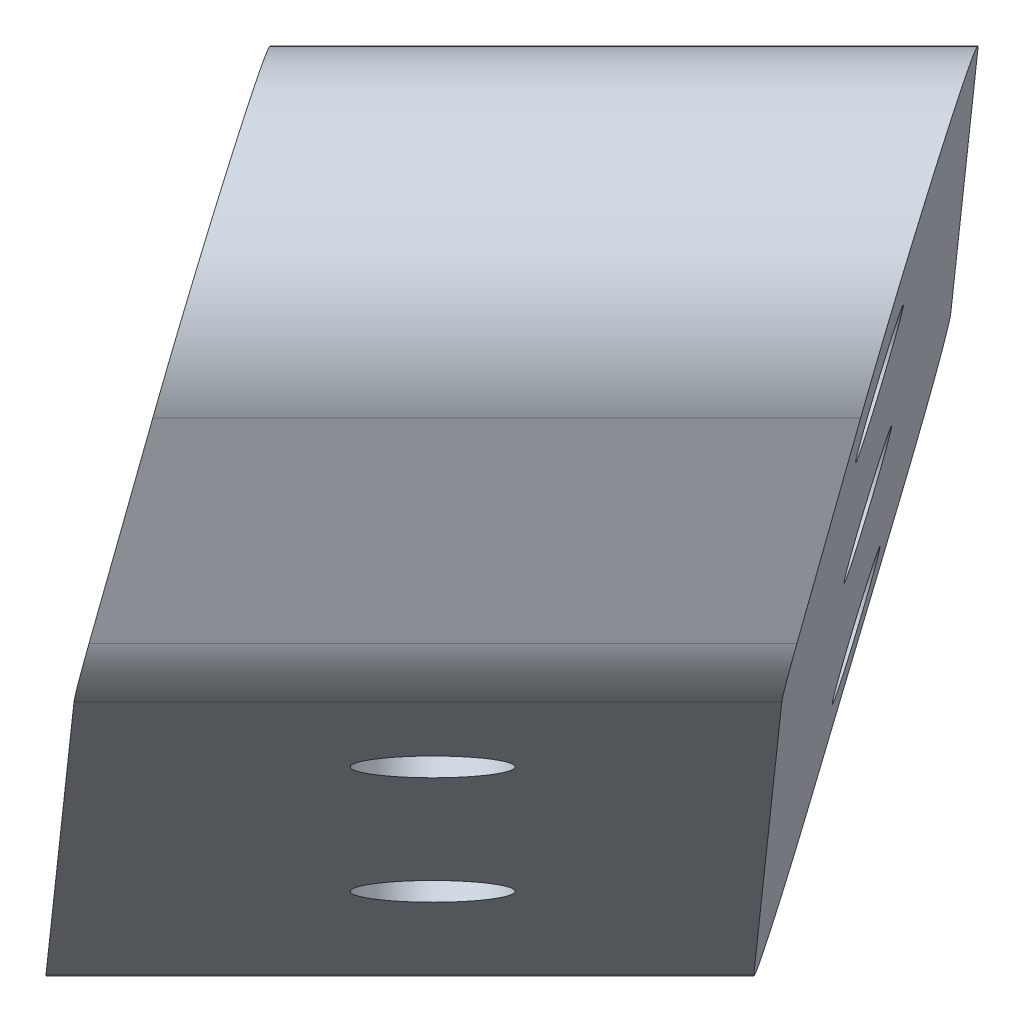
ISO-10303-21;
HEADER;
FILE_DESCRIPTION(('STEP AP214'),'2;1');
FILE_NAME('part.step','',(''),(''),'','','');
FILE_SCHEMA(('AUTOMOTIVE_DESIGN { 1 0 10303 214 1 1 1 1 }'));
ENDSEC;
DATA;
#1=APPLICATION_CONTEXT('core data for automotive mechanical design processes');
#2=APPLICATION_PROTOCOL_DEFINITION('international standard','automotive_design',2000,#1);
#3=PRODUCT_CONTEXT('',#1,'mechanical');
#4=PRODUCT('Part','Part','',(#3));
#5=PRODUCT_RELATED_PRODUCT_CATEGORY('part','',(#4));
#6=PRODUCT_DEFINITION_FORMATION('','',#4);
#7=PRODUCT_DEFINITION_CONTEXT('part definition',#1,'design');
#8=PRODUCT_DEFINITION('design','',#6,#7);
#9=PRODUCT_DEFINITION_SHAPE('','',#8);
#10=(LENGTH_UNIT() NAMED_UNIT(*) SI_UNIT(.MILLI.,.METRE.));
#11=(NAMED_UNIT(*) PLANE_ANGLE_UNIT() SI_UNIT($,.RADIAN.));
#12=(NAMED_UNIT(*) SI_UNIT($,.STERADIAN.) SOLID_ANGLE_UNIT());
#13=UNCERTAINTY_MEASURE_WITH_UNIT(LENGTH_MEASURE(1.E-05),#10,'distance_accuracy_value','');
#14=(GEOMETRIC_REPRESENTATION_CONTEXT(3) GLOBAL_UNCERTAINTY_ASSIGNED_CONTEXT((#13)) GLOBAL_UNIT_ASSIGNED_CONTEXT((#10,
#11,#12)) REPRESENTATION_CONTEXT('',''));
#15=CARTESIAN_POINT('',(0.,0.,0.));
#16=DIRECTION('',(0.,0.,1.));
#17=DIRECTION('',(1.,0.,0.));
#18=AXIS2_PLACEMENT_3D('',#15,#16,#17);
#19=CARTESIAN_POINT('',(211.29514255772,-94.0152812120288,94.4577052873248));
#20=DIRECTION('',(-0.635670633382854,-0.438001931170719,-0.635670633382856));
#21=DIRECTION('',(-0.707106781186548,0.,0.707106781186547));
#22=AXIS2_PLACEMENT_3D('',#19,#20,#21);
#23=PLANE('',#22);
#24=DIRECTION('',(-0.0983208560786328,0.86268066578759,-0.496099867099605));
#25=VECTOR('',#24,1.);
#26=CARTESIAN_POINT('',(202.848930690601,-112.979375377934,115.970919830593));
#27=LINE('',#26,#25);
#28=CARTESIAN_POINT('',(202.32292624561,-108.36414029038,113.316846771614));
#29=VERTEX_POINT('',#28);
#30=CARTESIAN_POINT('',(201.656406577888,-102.516005381434,109.953772732554));
#31=VERTEX_POINT('',#30);
#32=EDGE_CURVE('E115',#29,#31,#27,.T.);
#33=ORIENTED_EDGE('',*,*,#32,.T.);
#34=DIRECTION('',(0.707106781186548,0.,-0.707106781186547));
#35=VECTOR('',#34,1.);
#36=CARTESIAN_POINT('',(214.223808290423,-102.516005381431,97.3863710200276));
#37=LINE('',#36,#35);
#38=CARTESIAN_POINT('',(212.263981330594,-102.516005381431,99.3461979798563));
#39=VERTEX_POINT('',#38);
#40=EDGE_CURVE('E165',#31,#39,#37,.T.);
#41=ORIENTED_EDGE('',*,*,#40,.T.);
#42=DIRECTION('',(0.0983208560786335,-0.86268066578759,0.496099867099605));
#43=VECTOR('',#42,1.);
#44=CARTESIAN_POINT('',(211.29514255772,-94.0152812120288,94.4577052873248));
#45=LINE('',#44,#43);
#46=CARTESIAN_POINT('',(212.930500998316,-108.364140290378,102.709272018916));
#47=VERTEX_POINT('',#46);
#48=EDGE_CURVE('E196',#39,#47,#45,.T.);
#49=ORIENTED_EDGE('',*,*,#48,.T.);
#50=DIRECTION('',(-0.707106781186548,0.,0.707106781186547));
#51=VECTOR('',#50,1.);
#52=CARTESIAN_POINT('',(216.238605143813,-108.364140290378,99.4011678734184));
#53=LINE('',#52,#51);
#54=EDGE_CURVE('E159',#47,#29,#53,.T.);
#55=ORIENTED_EDGE('',*,*,#54,.T.);
#56=EDGE_LOOP('',(#33,#41,#49,#55));
#57=FACE_BOUND('',#56,.T.);
#58=ADVANCED_FACE('F41',(#57),#23,.T.);
#59=CARTESIAN_POINT('',(239.309137763312,-78.5635642195269,129.822442501016));
#60=DIRECTION('',(0.707106781186547,0.,0.707106781186548));
#61=DIRECTION('',(0.707106781186548,0.,-0.707106781186547));
#62=AXIS2_PLACEMENT_3D('',#59,#60,#61);
#63=PLANE('',#62);
#64=DIRECTION('',(0.158999682000955,0.97439119569462,-0.158999682000952));
#65=VECTOR('',#64,1.);
#66=CARTESIAN_POINT('',(239.309137763312,-78.5635642195269,129.822442501016));
#67=LINE('',#66,#65);
#68=CARTESIAN_POINT('',(239.522788555568,-77.2542568781109,129.608791708761));
#69=VERTEX_POINT('',#68);
#70=CARTESIAN_POINT('',(240.476466797243,-71.4098698295326,128.655113467085));
#71=VERTEX_POINT('',#70);
#72=EDGE_CURVE('E139',#69,#71,#67,.T.);
#73=ORIENTED_EDGE('',*,*,#72,.T.);
#74=DIRECTION('',(-0.707106781186548,0.,0.707106781186547));
#75=VECTOR('',#74,1.);
#76=CARTESIAN_POINT('',(239.309137763312,-71.4098698295326,129.822442501016));
#77=LINE('',#76,#75);
#78=CARTESIAN_POINT('',(229.868892044541,-71.4098698295326,139.262688219788));
#79=VERTEX_POINT('',#78);
#80=EDGE_CURVE('E11',#71,#79,#77,.T.);
#81=ORIENTED_EDGE('',*,*,#80,.T.);
#82=DIRECTION('',(-0.158999682000957,-0.97439119569462,0.158999682000954));
#83=VECTOR('',#82,1.);
#84=CARTESIAN_POINT('',(229.237901059904,-75.2767458651046,139.893679204425));
#85=LINE('',#84,#83);
#86=CARTESIAN_POINT('',(228.915213802865,-77.254256878111,140.216366461464));
#87=VERTEX_POINT('',#86);
#88=EDGE_CURVE('E217',#79,#87,#85,.T.);
#89=ORIENTED_EDGE('',*,*,#88,.T.);
#90=DIRECTION('',(-0.707106781186548,0.,0.707106781186547));
#91=VECTOR('',#90,1.);
#92=CARTESIAN_POINT('',(239.309137763312,-77.2542568781109,129.822442501016));
#93=LINE('',#92,#91);
#94=EDGE_CURVE('E151',#87,#69,#93,.F.);
#95=ORIENTED_EDGE('',*,*,#94,.T.);
#96=EDGE_LOOP('',(#73,#81,#89,#95));
#97=FACE_BOUND('',#96,.T.);
#98=ADVANCED_FACE('F249',(#97),#63,.T.);
#99=CARTESIAN_POINT('',(113.5360697668,-30.9927506207114,-76.39552603978));
#100=DIRECTION('',(-0.809172566386445,0.220885605875265,0.544471585048009));
#101=DIRECTION('',(0.558260781142676,0.,0.829665535163399));
#102=AXIS2_PLACEMENT_3D('',#99,#100,#101);
#103=PLANE('',#102);
#104=CARTESIAN_POINT('',(215.344864779369,-101.859589814984,103.65858760929));
#105=DIRECTION('',(0.809172566386445,-0.220885605875266,-0.544471585048008));
#106=DIRECTION('',(-0.558260781142675,0.,-0.8296655351634));
#107=AXIS2_PLACEMENT_3D('',#104,#105,#106);
#108=CIRCLE('',#107,1.75000000000021);
#109=CARTESIAN_POINT('',(214.367908412369,-101.859589814984,102.206672922754));
#110=VERTEX_POINT('',#109);
#111=EDGE_CURVE('E228',#110,#110,#108,.T.);
#112=ORIENTED_EDGE('',*,*,#111,.F.);
#113=EDGE_LOOP('',(#112));
#114=FACE_BOUND('',#113,.T.);
#115=CARTESIAN_POINT('',(225.92476635843,-88.3157293857225,113.887445182356));
#116=DIRECTION('',(0.809172566386445,-0.220885605875266,-0.544471585048008));
#117=DIRECTION('',(-0.558260781142675,0.,-0.8296655351634));
#118=AXIS2_PLACEMENT_3D('',#115,#116,#117);
#119=CIRCLE('',#118,1.75000000000026);
#120=CARTESIAN_POINT('',(224.94780999143,-88.3157293857225,112.43553049582));
#121=VERTEX_POINT('',#120);
#122=EDGE_CURVE('E220',#121,#121,#119,.T.);
#123=ORIENTED_EDGE('',*,*,#122,.F.);
#124=EDGE_LOOP('',(#123));
#125=FACE_BOUND('',#124,.T.);
#126=CARTESIAN_POINT('',(236.504667937491,-74.7718689564612,124.116302755422));
#127=DIRECTION('',(0.809172566386445,-0.220885605875266,-0.544471585048008));
#128=DIRECTION('',(-0.558260781142675,0.,-0.8296655351634));
#129=AXIS2_PLACEMENT_3D('',#126,#127,#128);
#130=CIRCLE('',#129,1.7500000000002);
#131=CARTESIAN_POINT('',(235.527711570492,-74.7718689564612,122.664388068886));
#132=VERTEX_POINT('',#131);
#133=EDGE_CURVE('E224',#132,#132,#130,.T.);
#134=ORIENTED_EDGE('',*,*,#133,.F.);
#135=EDGE_LOOP('',(#134));
#136=FACE_BOUND('',#135,.T.);
#137=ORIENTED_EDGE('',*,*,#48,.F.);
#138=CARTESIAN_POINT('',(215.178179703032,-100.325995725577,102.788705941247));
#139=DIRECTION('',(-0.809172566386445,0.220885605875265,0.544471585048009));
#140=DIRECTION('',(-0.232829945707229,0.73025303662238,-0.642277758361414));
#141=AXIS2_PLACEMENT_3D('',#138,#139,#140);
#142=ELLIPSE('',#141,5.22372722873458,5.);
#143=CARTESIAN_POINT('',(213.842365611367,-96.6599351696128,99.3161939208435));
#144=VERTEX_POINT('',#143);
#145=EDGE_CURVE('E172',#39,#144,#142,.F.);
#146=ORIENTED_EDGE('',*,*,#145,.T.);
#147=DIRECTION('',(-0.527989065999957,-0.679937623467728,-0.508834329008521));
#148=VECTOR('',#147,1.);
#149=CARTESIAN_POINT('',(162.247700073995,-163.102891147598,49.5933138278502));
#150=LINE('',#149,#148);
#151=CARTESIAN_POINT('',(236.296481661491,-67.7438092735679,120.955704678904));
#152=VERTEX_POINT('',#151);
#153=EDGE_CURVE('E194',#152,#144,#150,.T.);
#154=ORIENTED_EDGE('',*,*,#153,.F.);
#155=CARTESIAN_POINT('',(237.632295753156,-71.4098698295326,124.428216699307));
#156=DIRECTION('',(-0.809172566386445,0.220885605875265,0.544471585048009));
#157=DIRECTION('',(0.232829945707228,-0.73025303662238,0.642277758361413));
#158=AXIS2_PLACEMENT_3D('',#155,#156,#157);
#159=ELLIPSE('',#158,5.22372722873458,5.);
#160=EDGE_CURVE('E169',#152,#71,#159,.F.);
#161=ORIENTED_EDGE('',*,*,#160,.T.);
#162=ORIENTED_EDGE('',*,*,#72,.F.);
#163=CARTESIAN_POINT('',(237.816285929115,-77.2542568781109,127.072653648094));
#164=DIRECTION('',(-0.809172566386445,0.220885605875265,0.544471585048009));
#165=DIRECTION('',(0.232829945707229,-0.730253036622379,0.642277758361414));
#166=AXIS2_PLACEMENT_3D('',#163,#164,#165);
#167=ELLIPSE('',#166,3.13423633724075,3.);
#168=CARTESIAN_POINT('',(238.617774384114,-79.4538932116897,129.156160860337));
#169=VERTEX_POINT('',#168);
#170=EDGE_CURVE('E156',#69,#169,#167,.F.);
#171=ORIENTED_EDGE('',*,*,#170,.T.);
#172=DIRECTION('',(0.527989065999957,0.679937623467728,0.508834329008521));
#173=VECTOR('',#172,1.);
#174=CARTESIAN_POINT('',(213.344884736597,-112.,104.800137840152));
#175=LINE('',#174,#173);
#176=CARTESIAN_POINT('',(215.480508476778,-109.249770830444,106.858284007992));
#177=VERTEX_POINT('',#176);
#178=EDGE_CURVE('E145',#177,#169,#175,.T.);
#179=ORIENTED_EDGE('',*,*,#178,.F.);
#180=CARTESIAN_POINT('',(214.679020021779,-107.050134496865,104.77477679575));
#181=DIRECTION('',(-0.809172566386445,0.220885605875265,0.544471585048009));
#182=DIRECTION('',(0.232829945707229,-0.730253036622379,0.642277758361414));
#183=AXIS2_PLACEMENT_3D('',#180,#181,#182);
#184=ELLIPSE('',#183,3.13423633724075,3.);
#185=EDGE_CURVE('E137',#177,#47,#184,.F.);
#186=ORIENTED_EDGE('',*,*,#185,.T.);
#187=EDGE_LOOP('',(#137,#146,#154,#161,#162,#171,#179,#186));
#188=FACE_BOUND('',#187,.T.);
#189=ADVANCED_FACE('F193',(#114,#125,#136,#188),#103,.F.);
#190=CARTESIAN_POINT('',(172.047895278047,-1.26907291474908,73.0508000859975));
#191=DIRECTION('',(0.480832611206852,-0.733212111192935,0.480832611206852));
#192=DIRECTION('',(0.,-0.548387096774193,-0.836224606246176));
#193=AXIS2_PLACEMENT_3D('',#190,#191,#192);
#194=CYLINDRICAL_SURFACE('',#193,1.74999999999996);
#195=CARTESIAN_POINT('',(227.974648489544,-86.5506695424108,128.977553297495));
#196=DIRECTION('',(0.480832611206852,-0.733212111192935,0.480832611206852));
#197=DIRECTION('',(0.,-0.548387096774194,-0.836224606246176));
#198=AXIS2_PLACEMENT_3D('',#195,#196,#197);
#199=CIRCLE('',#198,1.74999999999996);
#200=CARTESIAN_POINT('',(227.974648489544,-87.5103469617656,127.514160236564));
#201=VERTEX_POINT('',#200);
#202=EDGE_CURVE('E236',#201,#201,#199,.T.);
#203=ORIENTED_EDGE('',*,*,#202,.T.);
#204=EDGE_LOOP('',(#203));
#205=FACE_BOUND('',#204,.T.);
#206=CARTESIAN_POINT('',(221.413603187686,-76.5458617043292,122.416507995637));
#207=DIRECTION('',(-0.480832611206852,0.733212111192935,-0.480832611206851));
#208=DIRECTION('',(-0.836224606246176,-0.548387096774193,0.));
#209=AXIS2_PLACEMENT_3D('',#206,#207,#208);
#210=CIRCLE('',#209,1.74999999999996);
#211=CARTESIAN_POINT('',(219.950210126755,-77.505539123684,122.416507995637));
#212=VERTEX_POINT('',#211);
#213=EDGE_CURVE('E188',#212,#212,#210,.F.);
#214=ORIENTED_EDGE('',*,*,#213,.F.);
#215=EDGE_LOOP('',(#214));
#216=FACE_BOUND('',#215,.T.);
#217=ADVANCED_FACE('F263',(#205,#216),#194,.F.);
#218=CARTESIAN_POINT('',(161.678710160594,-14.8690729147491,62.6816149685448));
#219=DIRECTION('',(0.480832611206852,-0.733212111192935,0.480832611206852));
#220=DIRECTION('',(0.,-0.548387096774193,-0.836224606246176));
#221=AXIS2_PLACEMENT_3D('',#218,#219,#220);
#222=CYLINDRICAL_SURFACE('',#221,1.74999999999998);
#223=CARTESIAN_POINT('',(217.605463372091,-100.150669542411,118.608368180042));
#224=DIRECTION('',(0.480832611206852,-0.733212111192935,0.480832611206852));
#225=DIRECTION('',(0.,-0.548387096774194,-0.836224606246176));
#226=AXIS2_PLACEMENT_3D('',#223,#224,#225);
#227=CIRCLE('',#226,1.74999999999998);
#228=CARTESIAN_POINT('',(217.605463372091,-101.110346961766,117.144975119111));
#229=VERTEX_POINT('',#228);
#230=EDGE_CURVE('E232',#229,#229,#227,.T.);
#231=ORIENTED_EDGE('',*,*,#230,.T.);
#232=EDGE_LOOP('',(#231));
#233=FACE_BOUND('',#232,.T.);
#234=CARTESIAN_POINT('',(211.044418070234,-90.1458617043292,112.047322878184));
#235=DIRECTION('',(-0.480832611206852,0.733212111192935,-0.480832611206851));
#236=DIRECTION('',(-0.836224606246176,-0.548387096774193,0.));
#237=AXIS2_PLACEMENT_3D('',#234,#235,#236);
#238=CIRCLE('',#237,1.74999999999998);
#239=CARTESIAN_POINT('',(209.581025009303,-91.105539123684,112.047322878184));
#240=VERTEX_POINT('',#239);
#241=EDGE_CURVE('E200',#240,#240,#238,.F.);
#242=ORIENTED_EDGE('',*,*,#241,.F.);
#243=EDGE_LOOP('',(#242));
#244=FACE_BOUND('',#243,.T.);
#245=ADVANCED_FACE('F285',(#233,#244),#222,.F.);
#246=CARTESIAN_POINT('',(202.848930690601,-112.979375377934,115.970919830593));
#247=DIRECTION('',(-0.809172566386443,0.220885605875266,0.544471585048011));
#248=DIRECTION('',(0.558260781142678,0.,0.829665535163398));
#249=AXIS2_PLACEMENT_3D('',#246,#247,#248);
#250=PLANE('',#249);
#251=CARTESIAN_POINT('',(224.88585492355,-71.6001987111428,131.934305738801));
#252=DIRECTION('',(-0.809172566386443,0.220885605875266,0.544471585048011));
#253=DIRECTION('',(0.558260781142678,0.,0.829665535163398));
#254=AXIS2_PLACEMENT_3D('',#251,#252,#253);
#255=CIRCLE('',#254,1.7500000000002);
#256=CARTESIAN_POINT('',(225.86281129055,-71.6001987111428,133.386220425337));
#257=VERTEX_POINT('',#256);
#258=EDGE_CURVE('E132',#257,#257,#255,.F.);
#259=ORIENTED_EDGE('',*,*,#258,.T.);
#260=EDGE_LOOP('',(#259));
#261=FACE_BOUND('',#260,.T.);
#262=CARTESIAN_POINT('',(214.305953344489,-85.144059140404,121.705448165735));
#263=DIRECTION('',(-0.809172566386443,0.220885605875266,0.544471585048011));
#264=DIRECTION('',(0.558260781142678,0.,0.829665535163398));
#265=AXIS2_PLACEMENT_3D('',#262,#263,#264);
#266=CIRCLE('',#265,1.75000000000026);
#267=CARTESIAN_POINT('',(215.282909711489,-85.144059140404,123.157362852271));
#268=VERTEX_POINT('',#267);
#269=EDGE_CURVE('E209',#268,#268,#266,.F.);
#270=ORIENTED_EDGE('',*,*,#269,.T.);
#271=EDGE_LOOP('',(#270));
#272=FACE_BOUND('',#271,.T.);
#273=CARTESIAN_POINT('',(203.726051765427,-98.6879195696652,111.476590592669));
#274=DIRECTION('',(-0.809172566386443,0.220885605875266,0.544471585048011));
#275=DIRECTION('',(0.558260781142678,0.,0.829665535163398));
#276=AXIS2_PLACEMENT_3D('',#273,#274,#275);
#277=CIRCLE('',#276,1.75000000000021);
#278=CARTESIAN_POINT('',(204.703008132427,-98.6879195696652,112.928505279205));
#279=VERTEX_POINT('',#278);
#280=EDGE_CURVE('E213',#279,#279,#277,.F.);
#281=ORIENTED_EDGE('',*,*,#280,.T.);
#282=EDGE_LOOP('',(#281));
#283=FACE_BOUND('',#282,.T.);
#284=DIRECTION('',(-0.527989065999958,-0.679937623467728,-0.50883432900852));
#285=VECTOR('',#284,1.);
#286=CARTESIAN_POINT('',(198.893172017548,-102.251016854686,105.739657955938));
#287=LINE('',#286,#285);
#288=CARTESIAN_POINT('',(225.688906908788,-67.7438092735679,131.563279431606));
#289=VERTEX_POINT('',#288);
#290=CARTESIAN_POINT('',(203.234790858664,-96.6599351696129,109.923768673546));
#291=VERTEX_POINT('',#290);
#292=EDGE_CURVE('E162',#289,#291,#287,.T.);
#293=ORIENTED_EDGE('',*,*,#292,.T.);
#294=CARTESIAN_POINT('',(204.570604950329,-100.325995725578,113.39628069395));
#295=DIRECTION('',(-0.809172566386443,0.220885605875266,0.544471585048011));
#296=DIRECTION('',(-0.232829945707225,0.730253036622384,-0.64227775836141));
#297=AXIS2_PLACEMENT_3D('',#294,#295,#296);
#298=ELLIPSE('',#297,5.22372722873458,5.);
#299=EDGE_CURVE('E50',#291,#31,#298,.T.);
#300=ORIENTED_EDGE('',*,*,#299,.T.);
#301=ORIENTED_EDGE('',*,*,#32,.F.);
#302=CARTESIAN_POINT('',(204.071445269076,-107.050134496865,115.382351548453));
#303=DIRECTION('',(-0.809172566386443,0.220885605875266,0.544471585048011));
#304=DIRECTION('',(0.232829945707225,-0.730253036622384,0.64227775836141));
#305=AXIS2_PLACEMENT_3D('',#302,#303,#304);
#306=ELLIPSE('',#305,3.13423633724075,3.);
#307=CARTESIAN_POINT('',(204.872933724075,-109.249770830444,117.465858760695));
#308=VERTEX_POINT('',#307);
#309=EDGE_CURVE('E109',#29,#308,#306,.T.);
#310=ORIENTED_EDGE('',*,*,#309,.T.);
#311=DIRECTION('',(0.527989065999958,0.679937623467728,0.508834329008519));
#312=VECTOR('',#311,1.);
#313=CARTESIAN_POINT('',(202.568142035103,-112.21785233914,115.244681830939));
#314=LINE('',#313,#312);
#315=CARTESIAN_POINT('',(228.010199631411,-79.4538932116898,139.763735613039));
#316=VERTEX_POINT('',#315);
#317=EDGE_CURVE('E113',#308,#316,#314,.T.);
#318=ORIENTED_EDGE('',*,*,#317,.T.);
#319=CARTESIAN_POINT('',(227.208711176412,-77.254256878111,137.680228400797));
#320=DIRECTION('',(-0.809172566386443,0.220885605875266,0.544471585048011));
#321=DIRECTION('',(0.232829945707225,-0.730253036622384,0.64227775836141));
#322=AXIS2_PLACEMENT_3D('',#319,#320,#321);
#323=ELLIPSE('',#322,3.13423633724075,3.);
#324=EDGE_CURVE('E121',#316,#87,#323,.T.);
#325=ORIENTED_EDGE('',*,*,#324,.T.);
#326=ORIENTED_EDGE('',*,*,#88,.F.);
#327=CARTESIAN_POINT('',(227.024721000453,-71.4098698295326,135.03579145201));
#328=DIRECTION('',(-0.809172566386443,0.220885605875266,0.544471585048011));
#329=DIRECTION('',(0.232829945707224,-0.730253036622385,0.642277758361409));
#330=AXIS2_PLACEMENT_3D('',#327,#328,#329);
#331=ELLIPSE('',#330,5.22372722873458,5.);
#332=EDGE_CURVE('E57',#79,#289,#331,.T.);
#333=ORIENTED_EDGE('',*,*,#332,.T.);
#334=EDGE_LOOP('',(#293,#300,#301,#310,#318,#325,#326,#333));
#335=FACE_BOUND('',#334,.T.);
#336=ADVANCED_FACE('F111',(#261,#272,#283,#335),#250,.T.);
#337=CARTESIAN_POINT('',(213.344884736597,-112.,104.800137840152));
#338=DIRECTION('',(0.480832611206852,-0.733212111192935,0.480832611206852));
#339=DIRECTION('',(0.836224606246176,0.548387096774193,0.));
#340=AXIS2_PLACEMENT_3D('',#337,#338,#339);
#341=PLANE('',#340);
#342=ORIENTED_EDGE('',*,*,#230,.F.);
#343=EDGE_LOOP('',(#342));
#344=FACE_BOUND('',#343,.T.);
#345=ORIENTED_EDGE('',*,*,#202,.F.);
#346=EDGE_LOOP('',(#345));
#347=FACE_BOUND('',#346,.T.);
#348=ORIENTED_EDGE('',*,*,#178,.T.);
#349=DIRECTION('',(-0.707106781186548,0.,0.707106781186547));
#350=VECTOR('',#349,1.);
#351=CARTESIAN_POINT('',(238.159341070448,-79.4538932116897,129.614594174003));
#352=LINE('',#351,#350);
#353=EDGE_CURVE('E122',#169,#316,#352,.T.);
#354=ORIENTED_EDGE('',*,*,#353,.T.);
#355=ORIENTED_EDGE('',*,*,#317,.F.);
#356=DIRECTION('',(-0.707106781186548,0.,0.707106781186547));
#357=VECTOR('',#356,1.);
#358=CARTESIAN_POINT('',(215.441769690607,-109.249770830444,106.897022794163));
#359=LINE('',#358,#357);
#360=EDGE_CURVE('E128',#308,#177,#359,.F.);
#361=ORIENTED_EDGE('',*,*,#360,.T.);
#362=EDGE_LOOP('',(#348,#354,#355,#361));
#363=FACE_BOUND('',#362,.T.);
#364=ADVANCED_FACE('F127',(#344,#347,#363),#341,.T.);
#365=CARTESIAN_POINT('',(151.876467473356,-84.534168792028,146.364853636058));
#366=DIRECTION('',(0.809172566386445,-0.220885605875266,-0.544471585048008));
#367=DIRECTION('',(-0.558260781142675,0.,-0.8296655351634));
#368=AXIS2_PLACEMENT_3D('',#365,#366,#367);
#369=CYLINDRICAL_SURFACE('',#368,1.75000000000021);
#370=ORIENTED_EDGE('',*,*,#111,.T.);
#371=EDGE_LOOP('',(#370));
#372=FACE_BOUND('',#371,.T.);
#373=ORIENTED_EDGE('',*,*,#280,.F.);
#374=EDGE_LOOP('',(#373));
#375=FACE_BOUND('',#374,.T.);
#376=ADVANCED_FACE('F266',(#372,#375),#369,.F.);
#377=CARTESIAN_POINT('',(162.456369052417,-70.9903083627668,156.593711209124));
#378=DIRECTION('',(0.809172566386445,-0.220885605875266,-0.544471585048008));
#379=DIRECTION('',(-0.558260781142675,0.,-0.8296655351634));
#380=AXIS2_PLACEMENT_3D('',#377,#378,#379);
#381=CYLINDRICAL_SURFACE('',#380,1.75000000000026);
#382=ORIENTED_EDGE('',*,*,#122,.T.);
#383=EDGE_LOOP('',(#382));
#384=FACE_BOUND('',#383,.T.);
#385=ORIENTED_EDGE('',*,*,#269,.F.);
#386=EDGE_LOOP('',(#385));
#387=FACE_BOUND('',#386,.T.);
#388=ADVANCED_FACE('F287',(#384,#387),#381,.F.);
#389=CARTESIAN_POINT('',(173.036270631478,-57.4464479335055,166.82256878219));
#390=DIRECTION('',(0.809172566386445,-0.220885605875266,-0.544471585048008));
#391=DIRECTION('',(-0.558260781142675,0.,-0.8296655351634));
#392=AXIS2_PLACEMENT_3D('',#389,#390,#391);
#393=CYLINDRICAL_SURFACE('',#392,1.7500000000002);
#394=ORIENTED_EDGE('',*,*,#133,.T.);
#395=EDGE_LOOP('',(#394));
#396=FACE_BOUND('',#395,.T.);
#397=ORIENTED_EDGE('',*,*,#258,.F.);
#398=EDGE_LOOP('',(#397));
#399=FACE_BOUND('',#398,.T.);
#400=ADVANCED_FACE('F274',(#396,#399),#393,.F.);
#401=CARTESIAN_POINT('',(236.716843236827,-77.2542568781109,128.172096340382));
#402=DIRECTION('',(-0.707106781186548,0.,0.707106781186547));
#403=DIRECTION('',(0.707106781186547,0.,0.707106781186548));
#404=AXIS2_PLACEMENT_3D('',#401,#402,#403);
#405=CYLINDRICAL_SURFACE('',#404,3.);
#406=ORIENTED_EDGE('',*,*,#170,.F.);
#407=ORIENTED_EDGE('',*,*,#94,.F.);
#408=ORIENTED_EDGE('',*,*,#324,.F.);
#409=ORIENTED_EDGE('',*,*,#353,.F.);
#410=EDGE_LOOP('',(#406,#407,#408,#409));
#411=FACE_BOUND('',#410,.T.);
#412=ADVANCED_FACE('F245',(#411),#405,.T.);
#413=CARTESIAN_POINT('',(218.145617043962,-107.050134496865,101.308179773567));
#414=DIRECTION('',(-0.707106781186548,0.,0.707106781186547));
#415=DIRECTION('',(0.707106781186547,0.,0.707106781186548));
#416=AXIS2_PLACEMENT_3D('',#413,#414,#415);
#417=CYLINDRICAL_SURFACE('',#416,3.);
#418=ORIENTED_EDGE('',*,*,#185,.F.);
#419=ORIENTED_EDGE('',*,*,#360,.F.);
#420=ORIENTED_EDGE('',*,*,#309,.F.);
#421=ORIENTED_EDGE('',*,*,#54,.F.);
#422=EDGE_LOOP('',(#418,#419,#420,#421));
#423=FACE_BOUND('',#422,.T.);
#424=ADVANCED_FACE('F135',(#423),#417,.T.);
#425=CARTESIAN_POINT('',(106.479940845146,-162.36914969393,106.479940845146));
#426=DIRECTION('',(-0.480832611206852,0.733212111192935,-0.480832611206851));
#427=DIRECTION('',(-0.836224606246176,-0.548387096774193,0.));
#428=AXIS2_PLACEMENT_3D('',#425,#426,#427);
#429=PLANE('',#428);
#430=ORIENTED_EDGE('',*,*,#153,.T.);
#431=DIRECTION('',(0.707106781186548,0.,-0.707106781186547));
#432=VECTOR('',#431,1.);
#433=CARTESIAN_POINT('',(156.579279766105,-96.659935169613,156.579279766105));
#434=LINE('',#433,#432);
#435=EDGE_CURVE('E64',#144,#291,#434,.F.);
#436=ORIENTED_EDGE('',*,*,#435,.T.);
#437=ORIENTED_EDGE('',*,*,#292,.F.);
#438=DIRECTION('',(-0.707106781186548,0.,0.707106781186547));
#439=VECTOR('',#438,1.);
#440=CARTESIAN_POINT('',(178.626093170197,-67.743809273568,178.626093170197));
#441=LINE('',#440,#439);
#442=EDGE_CURVE('E175',#289,#152,#441,.F.);
#443=ORIENTED_EDGE('',*,*,#442,.T.);
#444=EDGE_LOOP('',(#430,#436,#437,#443));
#445=FACE_BOUND('',#444,.T.);
#446=ORIENTED_EDGE('',*,*,#241,.T.);
#447=EDGE_LOOP('',(#446));
#448=FACE_BOUND('',#447,.T.);
#449=ORIENTED_EDGE('',*,*,#213,.T.);
#450=EDGE_LOOP('',(#449));
#451=FACE_BOUND('',#450,.T.);
#452=ADVANCED_FACE('F197',(#445,#448,#451),#429,.T.);
#453=CARTESIAN_POINT('',(217.402161457337,-100.325995725577,100.564724186942));
#454=DIRECTION('',(0.707106781186548,0.,-0.707106781186547));
#455=DIRECTION('',(-0.707106781186547,0.,-0.707106781186548));
#456=AXIS2_PLACEMENT_3D('',#453,#454,#455);
#457=CYLINDRICAL_SURFACE('',#456,5.);
#458=ORIENTED_EDGE('',*,*,#299,.F.);
#459=ORIENTED_EDGE('',*,*,#435,.F.);
#460=ORIENTED_EDGE('',*,*,#145,.F.);
#461=ORIENTED_EDGE('',*,*,#40,.F.);
#462=EDGE_LOOP('',(#458,#459,#460,#461));
#463=FACE_BOUND('',#462,.T.);
#464=ADVANCED_FACE('F190',(#463),#457,.T.);
#465=CARTESIAN_POINT('',(235.77360385738,-71.4098698295326,126.286908595084));
#466=DIRECTION('',(-0.707106781186548,0.,0.707106781186547));
#467=DIRECTION('',(0.707106781186547,0.,0.707106781186548));
#468=AXIS2_PLACEMENT_3D('',#465,#466,#467);
#469=CYLINDRICAL_SURFACE('',#468,5.);
#470=ORIENTED_EDGE('',*,*,#160,.F.);
#471=ORIENTED_EDGE('',*,*,#442,.F.);
#472=ORIENTED_EDGE('',*,*,#332,.F.);
#473=ORIENTED_EDGE('',*,*,#80,.F.);
#474=EDGE_LOOP('',(#470,#471,#472,#473));
#475=FACE_BOUND('',#474,.T.);
#476=ADVANCED_FACE('F43',(#475),#469,.T.);
#477=CLOSED_SHELL('',(#58,#98,#189,#217,#245,#336,#364,#376,#388,#400,#412,#424,#452,#464,#476));
#478=MANIFOLD_SOLID_BREP('B2',#477);
#479=ADVANCED_BREP_SHAPE_REPRESENTATION('',(#18,#478),#14);
#480=SHAPE_DEFINITION_REPRESENTATION(#9,#479);
ENDSEC;
END-ISO-10303-21;
